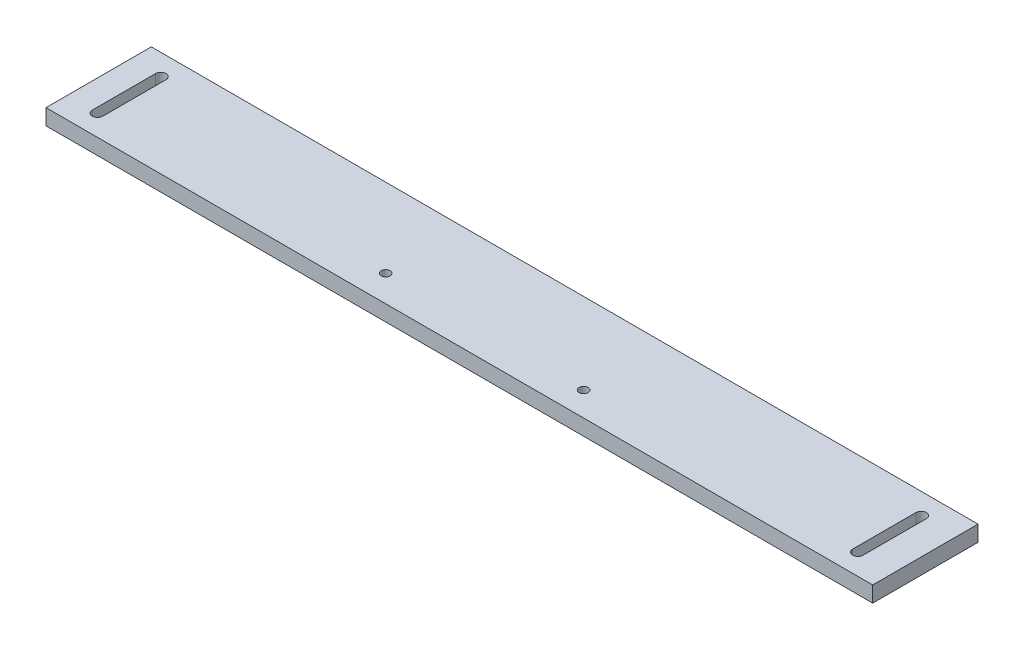
ISO-10303-21;
HEADER;
FILE_DESCRIPTION(('STEP AP214'),'2;1');
FILE_NAME('part.step','',(''),(''),'','','');
FILE_SCHEMA(('AUTOMOTIVE_DESIGN { 1 0 10303 214 1 1 1 1 }'));
ENDSEC;
DATA;
#1=APPLICATION_CONTEXT('core data for automotive mechanical design processes');
#2=APPLICATION_PROTOCOL_DEFINITION('international standard','automotive_design',2000,#1);
#3=PRODUCT_CONTEXT('',#1,'mechanical');
#4=PRODUCT('Part','Part','',(#3));
#5=PRODUCT_RELATED_PRODUCT_CATEGORY('part','',(#4));
#6=PRODUCT_DEFINITION_FORMATION('','',#4);
#7=PRODUCT_DEFINITION_CONTEXT('part definition',#1,'design');
#8=PRODUCT_DEFINITION('design','',#6,#7);
#9=PRODUCT_DEFINITION_SHAPE('','',#8);
#10=(LENGTH_UNIT() NAMED_UNIT(*) SI_UNIT(.MILLI.,.METRE.));
#11=(NAMED_UNIT(*) PLANE_ANGLE_UNIT() SI_UNIT($,.RADIAN.));
#12=(NAMED_UNIT(*) SI_UNIT($,.STERADIAN.) SOLID_ANGLE_UNIT());
#13=UNCERTAINTY_MEASURE_WITH_UNIT(LENGTH_MEASURE(1.E-05),#10,'distance_accuracy_value','');
#14=(GEOMETRIC_REPRESENTATION_CONTEXT(3) GLOBAL_UNCERTAINTY_ASSIGNED_CONTEXT((#13)) GLOBAL_UNIT_ASSIGNED_CONTEXT((#10,
#11,#12)) REPRESENTATION_CONTEXT('',''));
#15=CARTESIAN_POINT('',(0.,0.,0.));
#16=DIRECTION('',(0.,0.,1.));
#17=DIRECTION('',(1.,0.,0.));
#18=AXIS2_PLACEMENT_3D('',#15,#16,#17);
#19=CARTESIAN_POINT('',(-38.5634110787172,-15.,-7.66690962099125));
#20=DIRECTION('',(-1.,0.,0.));
#21=DIRECTION('',(0.,0.,1.));
#22=AXIS2_PLACEMENT_3D('',#19,#20,#21);
#23=PLANE('',#22);
#24=DIRECTION('',(0.,0.,1.));
#25=VECTOR('',#24,1.);
#26=CARTESIAN_POINT('',(-38.5634110787172,0.,-7.66690962099125));
#27=LINE('',#26,#25);
#28=CARTESIAN_POINT('',(-38.5634110787172,0.,-7.66690962099125));
#29=VERTEX_POINT('',#28);
#30=CARTESIAN_POINT('',(-38.5634110787172,0.,92.3330903790088));
#31=VERTEX_POINT('',#30);
#32=EDGE_CURVE('E200',#29,#31,#27,.T.);
#33=ORIENTED_EDGE('',*,*,#32,.F.);
#34=DIRECTION('',(0.,1.,0.));
#35=VECTOR('',#34,1.);
#36=CARTESIAN_POINT('',(-38.5634110787172,-15.,-7.66690962099125));
#37=LINE('',#36,#35);
#38=CARTESIAN_POINT('',(-38.5634110787172,-15.,-7.66690962099125));
#39=VERTEX_POINT('',#38);
#40=EDGE_CURVE('E11',#39,#29,#37,.T.);
#41=ORIENTED_EDGE('',*,*,#40,.F.);
#42=DIRECTION('',(0.,0.,1.));
#43=VECTOR('',#42,1.);
#44=CARTESIAN_POINT('',(-38.5634110787172,-15.,-7.66690962099125));
#45=LINE('',#44,#43);
#46=CARTESIAN_POINT('',(-38.5634110787172,-15.,92.3330903790088));
#47=VERTEX_POINT('',#46);
#48=EDGE_CURVE('E203',#39,#47,#45,.T.);
#49=ORIENTED_EDGE('',*,*,#48,.T.);
#50=DIRECTION('',(0.,1.,0.));
#51=VECTOR('',#50,1.);
#52=CARTESIAN_POINT('',(-38.5634110787172,-15.,92.3330903790088));
#53=LINE('',#52,#51);
#54=EDGE_CURVE('E36',#47,#31,#53,.T.);
#55=ORIENTED_EDGE('',*,*,#54,.T.);
#56=EDGE_LOOP('',(#33,#41,#49,#55));
#57=FACE_BOUND('',#56,.T.);
#58=ADVANCED_FACE('F33',(#57),#23,.T.);
#59=CARTESIAN_POINT('',(-38.5634110787172,-15.,-7.66690962099125));
#60=DIRECTION('',(0.,0.,1.));
#61=DIRECTION('',(1.,0.,0.));
#62=AXIS2_PLACEMENT_3D('',#59,#60,#61);
#63=PLANE('',#62);
#64=DIRECTION('',(1.,0.,0.));
#65=VECTOR('',#64,1.);
#66=CARTESIAN_POINT('',(-38.5634110787172,0.,-7.66690962099125));
#67=LINE('',#66,#65);
#68=CARTESIAN_POINT('',(746.436588921283,0.,-7.66690962099125));
#69=VERTEX_POINT('',#68);
#70=EDGE_CURVE('E207',#29,#69,#67,.T.);
#71=ORIENTED_EDGE('',*,*,#70,.T.);
#72=DIRECTION('',(0.,1.,0.));
#73=VECTOR('',#72,1.);
#74=CARTESIAN_POINT('',(746.436588921283,-15.,-7.66690962099125));
#75=LINE('',#74,#73);
#76=CARTESIAN_POINT('',(746.436588921283,-15.,-7.66690962099125));
#77=VERTEX_POINT('',#76);
#78=EDGE_CURVE('E41',#77,#69,#75,.T.);
#79=ORIENTED_EDGE('',*,*,#78,.F.);
#80=DIRECTION('',(1.,0.,0.));
#81=VECTOR('',#80,1.);
#82=CARTESIAN_POINT('',(-38.5634110787172,-15.,-7.66690962099125));
#83=LINE('',#82,#81);
#84=EDGE_CURVE('E212',#39,#77,#83,.T.);
#85=ORIENTED_EDGE('',*,*,#84,.F.);
#86=ORIENTED_EDGE('',*,*,#40,.T.);
#87=EDGE_LOOP('',(#71,#79,#85,#86));
#88=FACE_BOUND('',#87,.T.);
#89=ADVANCED_FACE('F239',(#88),#63,.F.);
#90=CARTESIAN_POINT('',(746.436588921283,-15.,-7.66690962099125));
#91=DIRECTION('',(-1.,0.,0.));
#92=DIRECTION('',(0.,0.,1.));
#93=AXIS2_PLACEMENT_3D('',#90,#91,#92);
#94=PLANE('',#93);
#95=DIRECTION('',(0.,0.,1.));
#96=VECTOR('',#95,1.);
#97=CARTESIAN_POINT('',(746.436588921283,0.,-7.66690962099125));
#98=LINE('',#97,#96);
#99=CARTESIAN_POINT('',(746.436588921283,0.,92.3330903790088));
#100=VERTEX_POINT('',#99);
#101=EDGE_CURVE('E219',#69,#100,#98,.T.);
#102=ORIENTED_EDGE('',*,*,#101,.T.);
#103=DIRECTION('',(0.,1.,0.));
#104=VECTOR('',#103,1.);
#105=CARTESIAN_POINT('',(746.436588921283,-15.,92.3330903790088));
#106=LINE('',#105,#104);
#107=CARTESIAN_POINT('',(746.436588921283,-15.,92.3330903790088));
#108=VERTEX_POINT('',#107);
#109=EDGE_CURVE('E224',#108,#100,#106,.T.);
#110=ORIENTED_EDGE('',*,*,#109,.F.);
#111=DIRECTION('',(0.,0.,1.));
#112=VECTOR('',#111,1.);
#113=CARTESIAN_POINT('',(746.436588921283,-15.,-7.66690962099125));
#114=LINE('',#113,#112);
#115=EDGE_CURVE('E210',#77,#108,#114,.T.);
#116=ORIENTED_EDGE('',*,*,#115,.F.);
#117=ORIENTED_EDGE('',*,*,#78,.T.);
#118=EDGE_LOOP('',(#102,#110,#116,#117));
#119=FACE_BOUND('',#118,.T.);
#120=ADVANCED_FACE('F243',(#119),#94,.F.);
#121=CARTESIAN_POINT('',(-38.5634110787172,-15.,92.3330903790088));
#122=DIRECTION('',(0.,0.,1.));
#123=DIRECTION('',(1.,0.,0.));
#124=AXIS2_PLACEMENT_3D('',#121,#122,#123);
#125=PLANE('',#124);
#126=DIRECTION('',(1.,0.,0.));
#127=VECTOR('',#126,1.);
#128=CARTESIAN_POINT('',(-38.5634110787172,0.,92.3330903790088));
#129=LINE('',#128,#127);
#130=EDGE_CURVE('E216',#31,#100,#129,.T.);
#131=ORIENTED_EDGE('',*,*,#130,.F.);
#132=ORIENTED_EDGE('',*,*,#54,.F.);
#133=DIRECTION('',(1.,0.,0.));
#134=VECTOR('',#133,1.);
#135=CARTESIAN_POINT('',(-38.5634110787172,-15.,92.3330903790088));
#136=LINE('',#135,#134);
#137=EDGE_CURVE('E206',#47,#108,#136,.T.);
#138=ORIENTED_EDGE('',*,*,#137,.T.);
#139=ORIENTED_EDGE('',*,*,#109,.T.);
#140=EDGE_LOOP('',(#131,#132,#138,#139));
#141=FACE_BOUND('',#140,.T.);
#142=ADVANCED_FACE('F232',(#141),#125,.T.);
#143=CARTESIAN_POINT('',(0.,-15.,0.));
#144=DIRECTION('',(0.,1.,0.));
#145=DIRECTION('',(0.,0.,1.));
#146=AXIS2_PLACEMENT_3D('',#143,#144,#145);
#147=PLANE('',#146);
#148=DIRECTION('',(0.,0.,-1.));
#149=VECTOR('',#148,1.);
#150=CARTESIAN_POINT('',(-4.56341107871719,-15.,12.3330903790088));
#151=LINE('',#150,#149);
#152=CARTESIAN_POINT('',(-4.56341107871718,-15.,72.3330903790088));
#153=VERTEX_POINT('',#152);
#154=CARTESIAN_POINT('',(-4.56341107871719,-15.,12.3330903790088));
#155=VERTEX_POINT('',#154);
#156=EDGE_CURVE('E130',#153,#155,#151,.T.);
#157=ORIENTED_EDGE('',*,*,#156,.T.);
#158=CARTESIAN_POINT('',(-9.56341107871719,-15.,12.3330903790088));
#159=DIRECTION('',(0.,1.,0.));
#160=DIRECTION('',(0.,0.,1.));
#161=AXIS2_PLACEMENT_3D('',#158,#159,#160);
#162=CIRCLE('',#161,5.);
#163=CARTESIAN_POINT('',(-14.5634110787172,-15.,12.3330903790088));
#164=VERTEX_POINT('',#163);
#165=EDGE_CURVE('E124',#155,#164,#162,.T.);
#166=ORIENTED_EDGE('',*,*,#165,.T.);
#167=DIRECTION('',(0.,0.,1.));
#168=VECTOR('',#167,1.);
#169=CARTESIAN_POINT('',(-14.5634110787172,-15.,12.3330903790088));
#170=LINE('',#169,#168);
#171=CARTESIAN_POINT('',(-14.5634110787172,-15.,72.3330903790088));
#172=VERTEX_POINT('',#171);
#173=EDGE_CURVE('E133',#164,#172,#170,.T.);
#174=ORIENTED_EDGE('',*,*,#173,.T.);
#175=CARTESIAN_POINT('',(-9.56341107871718,-15.,72.3330903790088));
#176=DIRECTION('',(0.,1.,0.));
#177=DIRECTION('',(0.,0.,1.));
#178=AXIS2_PLACEMENT_3D('',#175,#176,#177);
#179=CIRCLE('',#178,5.);
#180=EDGE_CURVE('E49',#172,#153,#179,.T.);
#181=ORIENTED_EDGE('',*,*,#180,.T.);
#182=EDGE_LOOP('',(#157,#166,#174,#181));
#183=FACE_BOUND('',#182,.T.);
#184=DIRECTION('',(0.,0.,1.));
#185=VECTOR('',#184,1.);
#186=CARTESIAN_POINT('',(707.436588921283,-15.,72.3330903790087));
#187=LINE('',#186,#185);
#188=CARTESIAN_POINT('',(707.436588921283,-15.,12.3330903790087));
#189=VERTEX_POINT('',#188);
#190=CARTESIAN_POINT('',(707.436588921283,-15.,72.3330903790087));
#191=VERTEX_POINT('',#190);
#192=EDGE_CURVE('E169',#189,#191,#187,.T.);
#193=ORIENTED_EDGE('',*,*,#192,.T.);
#194=CARTESIAN_POINT('',(712.436588921283,-15.,72.3330903790087));
#195=DIRECTION('',(0.,1.,0.));
#196=DIRECTION('',(0.,0.,1.));
#197=AXIS2_PLACEMENT_3D('',#194,#195,#196);
#198=CIRCLE('',#197,5.);
#199=CARTESIAN_POINT('',(717.436588921283,-15.,72.3330903790087));
#200=VERTEX_POINT('',#199);
#201=EDGE_CURVE('E159',#191,#200,#198,.T.);
#202=ORIENTED_EDGE('',*,*,#201,.T.);
#203=DIRECTION('',(0.,0.,-1.));
#204=VECTOR('',#203,1.);
#205=CARTESIAN_POINT('',(717.436588921283,-15.,72.3330903790087));
#206=LINE('',#205,#204);
#207=CARTESIAN_POINT('',(717.436588921283,-15.,12.3330903790088));
#208=VERTEX_POINT('',#207);
#209=EDGE_CURVE('E162',#200,#208,#206,.T.);
#210=ORIENTED_EDGE('',*,*,#209,.T.);
#211=CARTESIAN_POINT('',(712.436588921283,-15.,12.3330903790088));
#212=DIRECTION('',(0.,1.,0.));
#213=DIRECTION('',(0.,0.,1.));
#214=AXIS2_PLACEMENT_3D('',#211,#212,#213);
#215=CIRCLE('',#214,5.);
#216=EDGE_CURVE('E166',#208,#189,#215,.T.);
#217=ORIENTED_EDGE('',*,*,#216,.T.);
#218=EDGE_LOOP('',(#193,#202,#210,#217));
#219=FACE_BOUND('',#218,.T.);
#220=CARTESIAN_POINT('',(448.926063480176,-15.,69.3329795848918));
#221=DIRECTION('',(0.,1.,0.));
#222=DIRECTION('',(0.,0.,1.));
#223=AXIS2_PLACEMENT_3D('',#220,#221,#222);
#224=CIRCLE('',#223,4.24999999999995);
#225=CARTESIAN_POINT('',(448.926063480176,-15.,73.5829795848918));
#226=VERTEX_POINT('',#225);
#227=EDGE_CURVE('E191',#226,#226,#224,.T.);
#228=ORIENTED_EDGE('',*,*,#227,.T.);
#229=EDGE_LOOP('',(#228));
#230=FACE_BOUND('',#229,.T.);
#231=CARTESIAN_POINT('',(258.936588921283,-15.,67.3330903790088));
#232=DIRECTION('',(0.,1.,0.));
#233=DIRECTION('',(0.,0.,1.));
#234=AXIS2_PLACEMENT_3D('',#231,#232,#233);
#235=CIRCLE('',#234,4.24999999999995);
#236=CARTESIAN_POINT('',(258.936588921283,-15.,71.5830903790087));
#237=VERTEX_POINT('',#236);
#238=EDGE_CURVE('E197',#237,#237,#235,.T.);
#239=ORIENTED_EDGE('',*,*,#238,.T.);
#240=EDGE_LOOP('',(#239));
#241=FACE_BOUND('',#240,.T.);
#242=ORIENTED_EDGE('',*,*,#48,.F.);
#243=ORIENTED_EDGE('',*,*,#84,.T.);
#244=ORIENTED_EDGE('',*,*,#115,.T.);
#245=ORIENTED_EDGE('',*,*,#137,.F.);
#246=EDGE_LOOP('',(#242,#243,#244,#245));
#247=FACE_BOUND('',#246,.T.);
#248=ADVANCED_FACE('F137',(#183,#219,#230,#241,#247),#147,.F.);
#249=CARTESIAN_POINT('',(0.,0.,0.));
#250=DIRECTION('',(0.,1.,0.));
#251=DIRECTION('',(0.,0.,1.));
#252=AXIS2_PLACEMENT_3D('',#249,#250,#251);
#253=PLANE('',#252);
#254=CARTESIAN_POINT('',(-9.56341107871719,0.,12.3330903790088));
#255=DIRECTION('',(0.,1.,0.));
#256=DIRECTION('',(0.,0.,1.));
#257=AXIS2_PLACEMENT_3D('',#254,#255,#256);
#258=CIRCLE('',#257,5.);
#259=CARTESIAN_POINT('',(-4.56341107871719,0.,12.3330903790088));
#260=VERTEX_POINT('',#259);
#261=CARTESIAN_POINT('',(-14.5634110787172,0.,12.3330903790088));
#262=VERTEX_POINT('',#261);
#263=EDGE_CURVE('E57',#260,#262,#258,.T.);
#264=ORIENTED_EDGE('',*,*,#263,.F.);
#265=DIRECTION('',(0.,0.,-1.));
#266=VECTOR('',#265,1.);
#267=CARTESIAN_POINT('',(-4.56341107871719,0.,12.3330903790088));
#268=LINE('',#267,#266);
#269=CARTESIAN_POINT('',(-4.56341107871718,0.,72.3330903790088));
#270=VERTEX_POINT('',#269);
#271=EDGE_CURVE('E140',#270,#260,#268,.T.);
#272=ORIENTED_EDGE('',*,*,#271,.F.);
#273=CARTESIAN_POINT('',(-9.56341107871718,0.,72.3330903790088));
#274=DIRECTION('',(0.,1.,0.));
#275=DIRECTION('',(0.,0.,1.));
#276=AXIS2_PLACEMENT_3D('',#273,#274,#275);
#277=CIRCLE('',#276,5.);
#278=CARTESIAN_POINT('',(-14.5634110787172,0.,72.3330903790088));
#279=VERTEX_POINT('',#278);
#280=EDGE_CURVE('E143',#279,#270,#277,.T.);
#281=ORIENTED_EDGE('',*,*,#280,.F.);
#282=DIRECTION('',(0.,0.,1.));
#283=VECTOR('',#282,1.);
#284=CARTESIAN_POINT('',(-14.5634110787172,0.,12.3330903790088));
#285=LINE('',#284,#283);
#286=EDGE_CURVE('E149',#262,#279,#285,.T.);
#287=ORIENTED_EDGE('',*,*,#286,.F.);
#288=EDGE_LOOP('',(#264,#272,#281,#287));
#289=FACE_BOUND('',#288,.T.);
#290=CARTESIAN_POINT('',(712.436588921283,0.,72.3330903790087));
#291=DIRECTION('',(0.,1.,0.));
#292=DIRECTION('',(0.,0.,1.));
#293=AXIS2_PLACEMENT_3D('',#290,#291,#292);
#294=CIRCLE('',#293,5.);
#295=CARTESIAN_POINT('',(707.436588921283,0.,72.3330903790087));
#296=VERTEX_POINT('',#295);
#297=CARTESIAN_POINT('',(717.436588921283,0.,72.3330903790087));
#298=VERTEX_POINT('',#297);
#299=EDGE_CURVE('E155',#296,#298,#294,.T.);
#300=ORIENTED_EDGE('',*,*,#299,.F.);
#301=DIRECTION('',(0.,0.,1.));
#302=VECTOR('',#301,1.);
#303=CARTESIAN_POINT('',(707.436588921283,0.,72.3330903790087));
#304=LINE('',#303,#302);
#305=CARTESIAN_POINT('',(707.436588921283,0.,12.3330903790087));
#306=VERTEX_POINT('',#305);
#307=EDGE_CURVE('E163',#306,#296,#304,.T.);
#308=ORIENTED_EDGE('',*,*,#307,.F.);
#309=CARTESIAN_POINT('',(712.436588921283,0.,12.3330903790088));
#310=DIRECTION('',(0.,1.,0.));
#311=DIRECTION('',(0.,0.,1.));
#312=AXIS2_PLACEMENT_3D('',#309,#310,#311);
#313=CIRCLE('',#312,5.);
#314=CARTESIAN_POINT('',(717.436588921283,0.,12.3330903790088));
#315=VERTEX_POINT('',#314);
#316=EDGE_CURVE('E177',#315,#306,#313,.T.);
#317=ORIENTED_EDGE('',*,*,#316,.F.);
#318=DIRECTION('',(0.,0.,-1.));
#319=VECTOR('',#318,1.);
#320=CARTESIAN_POINT('',(717.436588921283,0.,72.3330903790087));
#321=LINE('',#320,#319);
#322=EDGE_CURVE('E174',#298,#315,#321,.T.);
#323=ORIENTED_EDGE('',*,*,#322,.F.);
#324=EDGE_LOOP('',(#300,#308,#317,#323));
#325=FACE_BOUND('',#324,.T.);
#326=CARTESIAN_POINT('',(448.926063480176,0.,69.3329795848918));
#327=DIRECTION('',(0.,1.,0.));
#328=DIRECTION('',(0.,0.,1.));
#329=AXIS2_PLACEMENT_3D('',#326,#327,#328);
#330=CIRCLE('',#329,4.24999999999995);
#331=CARTESIAN_POINT('',(448.926063480176,0.,73.5829795848918));
#332=VERTEX_POINT('',#331);
#333=EDGE_CURVE('E184',#332,#332,#330,.T.);
#334=ORIENTED_EDGE('',*,*,#333,.F.);
#335=EDGE_LOOP('',(#334));
#336=FACE_BOUND('',#335,.T.);
#337=CARTESIAN_POINT('',(258.936588921283,0.,67.3330903790088));
#338=DIRECTION('',(0.,1.,0.));
#339=DIRECTION('',(0.,0.,1.));
#340=AXIS2_PLACEMENT_3D('',#337,#338,#339);
#341=CIRCLE('',#340,4.24999999999995);
#342=CARTESIAN_POINT('',(258.936588921283,0.,71.5830903790087));
#343=VERTEX_POINT('',#342);
#344=EDGE_CURVE('E194',#343,#343,#341,.T.);
#345=ORIENTED_EDGE('',*,*,#344,.F.);
#346=EDGE_LOOP('',(#345));
#347=FACE_BOUND('',#346,.T.);
#348=ORIENTED_EDGE('',*,*,#32,.T.);
#349=ORIENTED_EDGE('',*,*,#130,.T.);
#350=ORIENTED_EDGE('',*,*,#101,.F.);
#351=ORIENTED_EDGE('',*,*,#70,.F.);
#352=EDGE_LOOP('',(#348,#349,#350,#351));
#353=FACE_BOUND('',#352,.T.);
#354=ADVANCED_FACE('F236',(#289,#325,#336,#347,#353),#253,.T.);
#355=CARTESIAN_POINT('',(258.936588921283,-15.,67.3330903790088));
#356=DIRECTION('',(0.,1.,0.));
#357=DIRECTION('',(0.,0.,1.));
#358=AXIS2_PLACEMENT_3D('',#355,#356,#357);
#359=CYLINDRICAL_SURFACE('',#358,4.24999999999995);
#360=ORIENTED_EDGE('',*,*,#238,.F.);
#361=EDGE_LOOP('',(#360));
#362=FACE_BOUND('',#361,.T.);
#363=ORIENTED_EDGE('',*,*,#344,.T.);
#364=EDGE_LOOP('',(#363));
#365=FACE_BOUND('',#364,.T.);
#366=ADVANCED_FACE('F251',(#362,#365),#359,.F.);
#367=CARTESIAN_POINT('',(448.926063480176,-15.,69.3329795848918));
#368=DIRECTION('',(0.,1.,0.));
#369=DIRECTION('',(0.,0.,1.));
#370=AXIS2_PLACEMENT_3D('',#367,#368,#369);
#371=CYLINDRICAL_SURFACE('',#370,4.24999999999995);
#372=ORIENTED_EDGE('',*,*,#227,.F.);
#373=EDGE_LOOP('',(#372));
#374=FACE_BOUND('',#373,.T.);
#375=ORIENTED_EDGE('',*,*,#333,.T.);
#376=EDGE_LOOP('',(#375));
#377=FACE_BOUND('',#376,.T.);
#378=ADVANCED_FACE('F280',(#374,#377),#371,.F.);
#379=CARTESIAN_POINT('',(712.436588921283,-15.,72.3330903790087));
#380=DIRECTION('',(0.,1.,0.));
#381=DIRECTION('',(0.,0.,1.));
#382=AXIS2_PLACEMENT_3D('',#379,#380,#381);
#383=CYLINDRICAL_SURFACE('',#382,5.);
#384=ORIENTED_EDGE('',*,*,#299,.T.);
#385=DIRECTION('',(0.,1.,0.));
#386=VECTOR('',#385,1.);
#387=CARTESIAN_POINT('',(717.436588921283,-15.,72.3330903790087));
#388=LINE('',#387,#386);
#389=EDGE_CURVE('E172',#200,#298,#388,.T.);
#390=ORIENTED_EDGE('',*,*,#389,.F.);
#391=ORIENTED_EDGE('',*,*,#201,.F.);
#392=DIRECTION('',(0.,1.,0.));
#393=VECTOR('',#392,1.);
#394=CARTESIAN_POINT('',(707.436588921283,-15.,72.3330903790087));
#395=LINE('',#394,#393);
#396=EDGE_CURVE('E182',#191,#296,#395,.T.);
#397=ORIENTED_EDGE('',*,*,#396,.T.);
#398=EDGE_LOOP('',(#384,#390,#391,#397));
#399=FACE_BOUND('',#398,.T.);
#400=ADVANCED_FACE('F289',(#399),#383,.F.);
#401=CARTESIAN_POINT('',(707.436588921283,-15.,72.3330903790087));
#402=DIRECTION('',(-1.,0.,0.));
#403=DIRECTION('',(0.,0.,1.));
#404=AXIS2_PLACEMENT_3D('',#401,#402,#403);
#405=PLANE('',#404);
#406=ORIENTED_EDGE('',*,*,#307,.T.);
#407=ORIENTED_EDGE('',*,*,#396,.F.);
#408=ORIENTED_EDGE('',*,*,#192,.F.);
#409=DIRECTION('',(0.,1.,0.));
#410=VECTOR('',#409,1.);
#411=CARTESIAN_POINT('',(707.436588921283,-15.,12.3330903790087));
#412=LINE('',#411,#410);
#413=EDGE_CURVE('E185',#189,#306,#412,.T.);
#414=ORIENTED_EDGE('',*,*,#413,.T.);
#415=EDGE_LOOP('',(#406,#407,#408,#414));
#416=FACE_BOUND('',#415,.T.);
#417=ADVANCED_FACE('F308',(#416),#405,.F.);
#418=CARTESIAN_POINT('',(712.436588921283,-15.,12.3330903790088));
#419=DIRECTION('',(0.,1.,0.));
#420=DIRECTION('',(0.,0.,1.));
#421=AXIS2_PLACEMENT_3D('',#418,#419,#420);
#422=CYLINDRICAL_SURFACE('',#421,5.);
#423=ORIENTED_EDGE('',*,*,#316,.T.);
#424=ORIENTED_EDGE('',*,*,#413,.F.);
#425=ORIENTED_EDGE('',*,*,#216,.F.);
#426=DIRECTION('',(0.,1.,0.));
#427=VECTOR('',#426,1.);
#428=CARTESIAN_POINT('',(717.436588921283,-15.,12.3330903790088));
#429=LINE('',#428,#427);
#430=EDGE_CURVE('E187',#208,#315,#429,.T.);
#431=ORIENTED_EDGE('',*,*,#430,.T.);
#432=EDGE_LOOP('',(#423,#424,#425,#431));
#433=FACE_BOUND('',#432,.T.);
#434=ADVANCED_FACE('F318',(#433),#422,.F.);
#435=CARTESIAN_POINT('',(717.436588921283,-15.,72.3330903790087));
#436=DIRECTION('',(1.,0.,0.));
#437=DIRECTION('',(0.,0.,-1.));
#438=AXIS2_PLACEMENT_3D('',#435,#436,#437);
#439=PLANE('',#438);
#440=ORIENTED_EDGE('',*,*,#322,.T.);
#441=ORIENTED_EDGE('',*,*,#430,.F.);
#442=ORIENTED_EDGE('',*,*,#209,.F.);
#443=ORIENTED_EDGE('',*,*,#389,.T.);
#444=EDGE_LOOP('',(#440,#441,#442,#443));
#445=FACE_BOUND('',#444,.T.);
#446=ADVANCED_FACE('F328',(#445),#439,.F.);
#447=CARTESIAN_POINT('',(-9.56341107871719,-15.,12.3330903790088));
#448=DIRECTION('',(0.,1.,0.));
#449=DIRECTION('',(0.,0.,1.));
#450=AXIS2_PLACEMENT_3D('',#447,#448,#449);
#451=CYLINDRICAL_SURFACE('',#450,5.);
#452=ORIENTED_EDGE('',*,*,#263,.T.);
#453=DIRECTION('',(0.,1.,0.));
#454=VECTOR('',#453,1.);
#455=CARTESIAN_POINT('',(-14.5634110787172,-15.,12.3330903790088));
#456=LINE('',#455,#454);
#457=EDGE_CURVE('E120',#164,#262,#456,.T.);
#458=ORIENTED_EDGE('',*,*,#457,.F.);
#459=ORIENTED_EDGE('',*,*,#165,.F.);
#460=DIRECTION('',(0.,1.,0.));
#461=VECTOR('',#460,1.);
#462=CARTESIAN_POINT('',(-4.56341107871719,-15.,12.3330903790088));
#463=LINE('',#462,#461);
#464=EDGE_CURVE('E153',#155,#260,#463,.T.);
#465=ORIENTED_EDGE('',*,*,#464,.T.);
#466=EDGE_LOOP('',(#452,#458,#459,#465));
#467=FACE_BOUND('',#466,.T.);
#468=ADVANCED_FACE('F122',(#467),#451,.F.);
#469=CARTESIAN_POINT('',(-4.56341107871719,-15.,12.3330903790088));
#470=DIRECTION('',(1.,0.,0.));
#471=DIRECTION('',(0.,0.,-1.));
#472=AXIS2_PLACEMENT_3D('',#469,#470,#471);
#473=PLANE('',#472);
#474=ORIENTED_EDGE('',*,*,#271,.T.);
#475=ORIENTED_EDGE('',*,*,#464,.F.);
#476=ORIENTED_EDGE('',*,*,#156,.F.);
#477=DIRECTION('',(0.,1.,0.));
#478=VECTOR('',#477,1.);
#479=CARTESIAN_POINT('',(-4.56341107871718,-15.,72.3330903790088));
#480=LINE('',#479,#478);
#481=EDGE_CURVE('E156',#153,#270,#480,.T.);
#482=ORIENTED_EDGE('',*,*,#481,.T.);
#483=EDGE_LOOP('',(#474,#475,#476,#482));
#484=FACE_BOUND('',#483,.T.);
#485=ADVANCED_FACE('F347',(#484),#473,.F.);
#486=CARTESIAN_POINT('',(-9.56341107871718,-15.,72.3330903790088));
#487=DIRECTION('',(0.,1.,0.));
#488=DIRECTION('',(0.,0.,1.));
#489=AXIS2_PLACEMENT_3D('',#486,#487,#488);
#490=CYLINDRICAL_SURFACE('',#489,5.);
#491=ORIENTED_EDGE('',*,*,#280,.T.);
#492=ORIENTED_EDGE('',*,*,#481,.F.);
#493=ORIENTED_EDGE('',*,*,#180,.F.);
#494=DIRECTION('',(0.,1.,0.));
#495=VECTOR('',#494,1.);
#496=CARTESIAN_POINT('',(-14.5634110787172,-15.,72.3330903790088));
#497=LINE('',#496,#495);
#498=EDGE_CURVE('E129',#172,#279,#497,.T.);
#499=ORIENTED_EDGE('',*,*,#498,.T.);
#500=EDGE_LOOP('',(#491,#492,#493,#499));
#501=FACE_BOUND('',#500,.T.);
#502=ADVANCED_FACE('F356',(#501),#490,.F.);
#503=CARTESIAN_POINT('',(-14.5634110787172,-15.,12.3330903790088));
#504=DIRECTION('',(-1.,0.,0.));
#505=DIRECTION('',(0.,0.,1.));
#506=AXIS2_PLACEMENT_3D('',#503,#504,#505);
#507=PLANE('',#506);
#508=ORIENTED_EDGE('',*,*,#286,.T.);
#509=ORIENTED_EDGE('',*,*,#498,.F.);
#510=ORIENTED_EDGE('',*,*,#173,.F.);
#511=ORIENTED_EDGE('',*,*,#457,.T.);
#512=EDGE_LOOP('',(#508,#509,#510,#511));
#513=FACE_BOUND('',#512,.T.);
#514=ADVANCED_FACE('F134',(#513),#507,.F.);
#515=CLOSED_SHELL('',(#58,#89,#120,#142,#248,#354,#366,#378,#400,#417,#434,#446,#468,#485,#502,#514));
#516=MANIFOLD_SOLID_BREP('B2',#515);
#517=ADVANCED_BREP_SHAPE_REPRESENTATION('',(#18,#516),#14);
#518=SHAPE_DEFINITION_REPRESENTATION(#9,#517);
ENDSEC;
END-ISO-10303-21;
